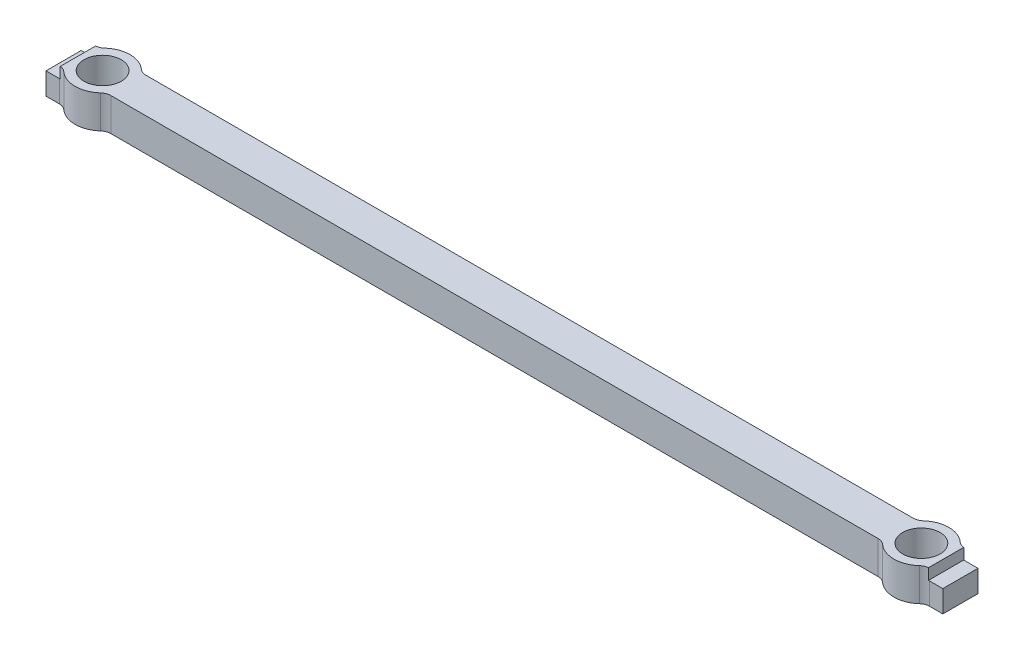
ISO-10303-21;
HEADER;
FILE_DESCRIPTION(('STEP AP214'),'2;1');
FILE_NAME('part.step','',(''),(''),'','','');
FILE_SCHEMA(('AUTOMOTIVE_DESIGN { 1 0 10303 214 1 1 1 1 }'));
ENDSEC;
DATA;
#1=APPLICATION_CONTEXT('core data for automotive mechanical design processes');
#2=APPLICATION_PROTOCOL_DEFINITION('international standard','automotive_design',2000,#1);
#3=PRODUCT_CONTEXT('',#1,'mechanical');
#4=PRODUCT('Part','Part','',(#3));
#5=PRODUCT_RELATED_PRODUCT_CATEGORY('part','',(#4));
#6=PRODUCT_DEFINITION_FORMATION('','',#4);
#7=PRODUCT_DEFINITION_CONTEXT('part definition',#1,'design');
#8=PRODUCT_DEFINITION('design','',#6,#7);
#9=PRODUCT_DEFINITION_SHAPE('','',#8);
#10=(LENGTH_UNIT() NAMED_UNIT(*) SI_UNIT(.MILLI.,.METRE.));
#11=(NAMED_UNIT(*) PLANE_ANGLE_UNIT() SI_UNIT($,.RADIAN.));
#12=(NAMED_UNIT(*) SI_UNIT($,.STERADIAN.) SOLID_ANGLE_UNIT());
#13=UNCERTAINTY_MEASURE_WITH_UNIT(LENGTH_MEASURE(1.E-05),#10,'distance_accuracy_value','');
#14=(GEOMETRIC_REPRESENTATION_CONTEXT(3) GLOBAL_UNCERTAINTY_ASSIGNED_CONTEXT((#13)) GLOBAL_UNIT_ASSIGNED_CONTEXT((#10,
#11,#12)) REPRESENTATION_CONTEXT('',''));
#15=CARTESIAN_POINT('',(0.,0.,0.));
#16=DIRECTION('',(0.,0.,1.));
#17=DIRECTION('',(1.,0.,0.));
#18=AXIS2_PLACEMENT_3D('',#15,#16,#17);
#19=CARTESIAN_POINT('',(0.,3.,-1.6));
#20=DIRECTION('',(0.,0.,1.));
#21=DIRECTION('',(1.,0.,0.));
#22=AXIS2_PLACEMENT_3D('',#19,#20,#21);
#23=PLANE('',#22);
#24=DIRECTION('',(1.,0.,0.));
#25=VECTOR('',#24,1.);
#26=CARTESIAN_POINT('',(0.,2.,-1.6));
#27=LINE('',#26,#25);
#28=CARTESIAN_POINT('',(-40.8,2.,-1.6));
#29=VERTEX_POINT('',#28);
#30=CARTESIAN_POINT('',(-39.593074902772,2.,-1.6));
#31=VERTEX_POINT('',#30);
#32=EDGE_CURVE('E473',#29,#31,#27,.T.);
#33=ORIENTED_EDGE('',*,*,#32,.T.);
#34=DIRECTION('',(0.,1.,0.));
#35=VECTOR('',#34,1.);
#36=CARTESIAN_POINT('',(-39.593074902772,0.,-1.6));
#37=LINE('',#36,#35);
#38=CARTESIAN_POINT('',(-39.593074902772,0.,-1.6));
#39=VERTEX_POINT('',#38);
#40=EDGE_CURVE('E277',#31,#39,#37,.F.);
#41=ORIENTED_EDGE('',*,*,#40,.T.);
#42=DIRECTION('',(-1.,0.,0.));
#43=VECTOR('',#42,1.);
#44=CARTESIAN_POINT('',(0.,0.,-1.6));
#45=LINE('',#44,#43);
#46=CARTESIAN_POINT('',(-40.8,0.,-1.6));
#47=VERTEX_POINT('',#46);
#48=EDGE_CURVE('E409',#39,#47,#45,.T.);
#49=ORIENTED_EDGE('',*,*,#48,.T.);
#50=DIRECTION('',(0.,-1.,0.));
#51=VECTOR('',#50,1.);
#52=CARTESIAN_POINT('',(-40.8,3.,-1.6));
#53=LINE('',#52,#51);
#54=EDGE_CURVE('E355',#29,#47,#53,.T.);
#55=ORIENTED_EDGE('',*,*,#54,.F.);
#56=EDGE_LOOP('',(#33,#41,#49,#55));
#57=FACE_BOUND('',#56,.T.);
#58=ADVANCED_FACE('F45',(#57),#23,.F.);
#59=CARTESIAN_POINT('',(-40.8,3.,0.));
#60=DIRECTION('',(1.,0.,0.));
#61=DIRECTION('',(0.,0.,-1.));
#62=AXIS2_PLACEMENT_3D('',#59,#60,#61);
#63=PLANE('',#62);
#64=DIRECTION('',(0.,0.,-1.));
#65=VECTOR('',#64,1.);
#66=CARTESIAN_POINT('',(-40.8,2.,0.));
#67=LINE('',#66,#65);
#68=CARTESIAN_POINT('',(-40.8,2.,1.6));
#69=VERTEX_POINT('',#68);
#70=EDGE_CURVE('E467',#69,#29,#67,.T.);
#71=ORIENTED_EDGE('',*,*,#70,.T.);
#72=ORIENTED_EDGE('',*,*,#54,.T.);
#73=DIRECTION('',(0.,0.,1.));
#74=VECTOR('',#73,1.);
#75=CARTESIAN_POINT('',(-40.8,0.,0.));
#76=LINE('',#75,#74);
#77=CARTESIAN_POINT('',(-40.8,0.,1.6));
#78=VERTEX_POINT('',#77);
#79=EDGE_CURVE('E412',#47,#78,#76,.T.);
#80=ORIENTED_EDGE('',*,*,#79,.T.);
#81=DIRECTION('',(0.,-1.,0.));
#82=VECTOR('',#81,1.);
#83=CARTESIAN_POINT('',(-40.8,3.,1.6));
#84=LINE('',#83,#82);
#85=EDGE_CURVE('E353',#69,#78,#84,.T.);
#86=ORIENTED_EDGE('',*,*,#85,.F.);
#87=EDGE_LOOP('',(#71,#72,#80,#86));
#88=FACE_BOUND('',#87,.T.);
#89=ADVANCED_FACE('F466',(#88),#63,.F.);
#90=CARTESIAN_POINT('',(0.,3.,1.6));
#91=DIRECTION('',(0.,0.,1.));
#92=DIRECTION('',(1.,0.,0.));
#93=AXIS2_PLACEMENT_3D('',#90,#91,#92);
#94=PLANE('',#93);
#95=DIRECTION('',(0.,-1.,0.));
#96=VECTOR('',#95,1.);
#97=CARTESIAN_POINT('',(-39.593074902772,3.,1.6));
#98=LINE('',#97,#96);
#99=CARTESIAN_POINT('',(-39.593074902772,0.,1.6));
#100=VERTEX_POINT('',#99);
#101=CARTESIAN_POINT('',(-39.593074902772,2.,1.6));
#102=VERTEX_POINT('',#101);
#103=EDGE_CURVE('E279',#100,#102,#98,.F.);
#104=ORIENTED_EDGE('',*,*,#103,.T.);
#105=DIRECTION('',(-1.,0.,0.));
#106=VECTOR('',#105,1.);
#107=CARTESIAN_POINT('',(0.,2.,1.6));
#108=LINE('',#107,#106);
#109=EDGE_CURVE('E60',#102,#69,#108,.T.);
#110=ORIENTED_EDGE('',*,*,#109,.T.);
#111=ORIENTED_EDGE('',*,*,#85,.T.);
#112=DIRECTION('',(-1.,0.,0.));
#113=VECTOR('',#112,1.);
#114=CARTESIAN_POINT('',(0.,0.,1.6));
#115=LINE('',#114,#113);
#116=EDGE_CURVE('E274',#100,#78,#115,.T.);
#117=ORIENTED_EDGE('',*,*,#116,.F.);
#118=EDGE_LOOP('',(#104,#110,#111,#117));
#119=FACE_BOUND('',#118,.T.);
#120=ADVANCED_FACE('F462',(#119),#94,.T.);
#121=CARTESIAN_POINT('',(0.,3.,1.6));
#122=DIRECTION('',(0.,0.,1.));
#123=DIRECTION('',(1.,0.,0.));
#124=AXIS2_PLACEMENT_3D('',#121,#122,#123);
#125=PLANE('',#124);
#126=DIRECTION('',(0.,-1.,0.));
#127=VECTOR('',#126,1.);
#128=CARTESIAN_POINT('',(40.8,3.,1.6));
#129=LINE('',#128,#127);
#130=CARTESIAN_POINT('',(40.8,2.,1.6));
#131=VERTEX_POINT('',#130);
#132=CARTESIAN_POINT('',(40.8,0.,1.6));
#133=VERTEX_POINT('',#132);
#134=EDGE_CURVE('E350',#131,#133,#129,.T.);
#135=ORIENTED_EDGE('',*,*,#134,.F.);
#136=DIRECTION('',(-1.,0.,0.));
#137=VECTOR('',#136,1.);
#138=CARTESIAN_POINT('',(0.,2.,1.6));
#139=LINE('',#138,#137);
#140=CARTESIAN_POINT('',(39.593074902772,2.,1.6));
#141=VERTEX_POINT('',#140);
#142=EDGE_CURVE('E438',#131,#141,#139,.T.);
#143=ORIENTED_EDGE('',*,*,#142,.T.);
#144=DIRECTION('',(0.,1.,0.));
#145=VECTOR('',#144,1.);
#146=CARTESIAN_POINT('',(39.593074902772,0.,1.6));
#147=LINE('',#146,#145);
#148=CARTESIAN_POINT('',(39.593074902772,0.,1.6));
#149=VERTEX_POINT('',#148);
#150=EDGE_CURVE('E296',#141,#149,#147,.F.);
#151=ORIENTED_EDGE('',*,*,#150,.T.);
#152=DIRECTION('',(-1.,0.,0.));
#153=VECTOR('',#152,1.);
#154=CARTESIAN_POINT('',(0.,0.,1.6));
#155=LINE('',#154,#153);
#156=EDGE_CURVE('E422',#133,#149,#155,.T.);
#157=ORIENTED_EDGE('',*,*,#156,.F.);
#158=EDGE_LOOP('',(#135,#143,#151,#157));
#159=FACE_BOUND('',#158,.T.);
#160=ADVANCED_FACE('F435',(#159),#125,.T.);
#161=CARTESIAN_POINT('',(40.8,3.,0.));
#162=DIRECTION('',(1.,0.,0.));
#163=DIRECTION('',(0.,0.,-1.));
#164=AXIS2_PLACEMENT_3D('',#161,#162,#163);
#165=PLANE('',#164);
#166=DIRECTION('',(0.,-1.,0.));
#167=VECTOR('',#166,1.);
#168=CARTESIAN_POINT('',(40.8,3.,-1.6));
#169=LINE('',#168,#167);
#170=CARTESIAN_POINT('',(40.8,2.,-1.6));
#171=VERTEX_POINT('',#170);
#172=CARTESIAN_POINT('',(40.8,0.,-1.6));
#173=VERTEX_POINT('',#172);
#174=EDGE_CURVE('E348',#171,#173,#169,.T.);
#175=ORIENTED_EDGE('',*,*,#174,.F.);
#176=DIRECTION('',(0.,0.,1.));
#177=VECTOR('',#176,1.);
#178=CARTESIAN_POINT('',(40.8,2.,0.));
#179=LINE('',#178,#177);
#180=EDGE_CURVE('E380',#171,#131,#179,.T.);
#181=ORIENTED_EDGE('',*,*,#180,.T.);
#182=ORIENTED_EDGE('',*,*,#134,.T.);
#183=DIRECTION('',(0.,0.,1.));
#184=VECTOR('',#183,1.);
#185=CARTESIAN_POINT('',(40.8,0.,0.));
#186=LINE('',#185,#184);
#187=EDGE_CURVE('E425',#173,#133,#186,.T.);
#188=ORIENTED_EDGE('',*,*,#187,.F.);
#189=EDGE_LOOP('',(#175,#181,#182,#188));
#190=FACE_BOUND('',#189,.T.);
#191=ADVANCED_FACE('F430',(#190),#165,.T.);
#192=CARTESIAN_POINT('',(0.,3.,-1.6));
#193=DIRECTION('',(0.,0.,1.));
#194=DIRECTION('',(1.,0.,0.));
#195=AXIS2_PLACEMENT_3D('',#192,#193,#194);
#196=PLANE('',#195);
#197=DIRECTION('',(1.,0.,0.));
#198=VECTOR('',#197,1.);
#199=CARTESIAN_POINT('',(0.,2.,-1.6));
#200=LINE('',#199,#198);
#201=CARTESIAN_POINT('',(39.593074902772,2.,-1.6));
#202=VERTEX_POINT('',#201);
#203=EDGE_CURVE('E367',#202,#171,#200,.T.);
#204=ORIENTED_EDGE('',*,*,#203,.T.);
#205=ORIENTED_EDGE('',*,*,#174,.T.);
#206=DIRECTION('',(-1.,0.,0.));
#207=VECTOR('',#206,1.);
#208=CARTESIAN_POINT('',(0.,0.,-1.6));
#209=LINE('',#208,#207);
#210=CARTESIAN_POINT('',(39.593074902772,0.,-1.6));
#211=VERTEX_POINT('',#210);
#212=EDGE_CURVE('E340',#173,#211,#209,.T.);
#213=ORIENTED_EDGE('',*,*,#212,.T.);
#214=DIRECTION('',(0.,-1.,0.));
#215=VECTOR('',#214,1.);
#216=CARTESIAN_POINT('',(39.593074902772,3.,-1.6));
#217=LINE('',#216,#215);
#218=EDGE_CURVE('E324',#211,#202,#217,.F.);
#219=ORIENTED_EDGE('',*,*,#218,.T.);
#220=EDGE_LOOP('',(#204,#205,#213,#219));
#221=FACE_BOUND('',#220,.T.);
#222=ADVANCED_FACE('F366',(#221),#196,.F.);
#223=CARTESIAN_POINT('',(0.,3.,0.));
#224=DIRECTION('',(0.,1.,0.));
#225=DIRECTION('',(0.,0.,1.));
#226=AXIS2_PLACEMENT_3D('',#223,#224,#225);
#227=PLANE('',#226);
#228=CARTESIAN_POINT('',(-37.25,3.,0.));
#229=DIRECTION('',(0.,1.,0.));
#230=DIRECTION('',(0.,0.,1.));
#231=AXIS2_PLACEMENT_3D('',#228,#229,#230);
#232=CIRCLE('',#231,1.7);
#233=CARTESIAN_POINT('',(-37.25,3.,1.7));
#234=VERTEX_POINT('',#233);
#235=EDGE_CURVE('E402',#234,#234,#232,.T.);
#236=ORIENTED_EDGE('',*,*,#235,.F.);
#237=EDGE_LOOP('',(#236));
#238=FACE_BOUND('',#237,.T.);
#239=CARTESIAN_POINT('',(37.25,3.,0.));
#240=DIRECTION('',(0.,1.,0.));
#241=DIRECTION('',(0.,0.,1.));
#242=AXIS2_PLACEMENT_3D('',#239,#240,#241);
#243=CIRCLE('',#242,1.7);
#244=CARTESIAN_POINT('',(37.25,3.,1.7));
#245=VERTEX_POINT('',#244);
#246=EDGE_CURVE('E351',#245,#245,#243,.F.);
#247=ORIENTED_EDGE('',*,*,#246,.T.);
#248=EDGE_LOOP('',(#247));
#249=FACE_BOUND('',#248,.T.);
#250=CARTESIAN_POINT('',(-39.593074902772,3.,-2.6));
#251=DIRECTION('',(0.,1.,0.));
#252=DIRECTION('',(0.,0.,1.));
#253=AXIS2_PLACEMENT_3D('',#250,#251,#252);
#254=CIRCLE('',#253,1.);
#255=CARTESIAN_POINT('',(-38.9236249305514,3.,-1.85714285714286));
#256=VERTEX_POINT('',#255);
#257=CARTESIAN_POINT('',(-39.5,3.,-1.60434089042786));
#258=VERTEX_POINT('',#257);
#259=EDGE_CURVE('E222',#256,#258,#254,.F.);
#260=ORIENTED_EDGE('',*,*,#259,.T.);
#261=DIRECTION('',(0.,0.,1.));
#262=VECTOR('',#261,1.);
#263=CARTESIAN_POINT('',(-39.5,3.,0.));
#264=LINE('',#263,#262);
#265=CARTESIAN_POINT('',(-39.5,3.,1.60434089042786));
#266=VERTEX_POINT('',#265);
#267=EDGE_CURVE('E207',#258,#266,#264,.T.);
#268=ORIENTED_EDGE('',*,*,#267,.T.);
#269=CARTESIAN_POINT('',(-39.593074902772,3.,2.6));
#270=DIRECTION('',(0.,1.,0.));
#271=DIRECTION('',(0.,0.,1.));
#272=AXIS2_PLACEMENT_3D('',#269,#270,#271);
#273=CIRCLE('',#272,1.);
#274=CARTESIAN_POINT('',(-38.9236249305514,3.,1.85714285714286));
#275=VERTEX_POINT('',#274);
#276=EDGE_CURVE('E242',#266,#275,#273,.F.);
#277=ORIENTED_EDGE('',*,*,#276,.T.);
#278=CARTESIAN_POINT('',(-37.25,3.,0.));
#279=DIRECTION('',(0.,1.,0.));
#280=DIRECTION('',(0.,0.,1.));
#281=AXIS2_PLACEMENT_3D('',#278,#279,#280);
#282=CIRCLE('',#281,2.5);
#283=CARTESIAN_POINT('',(-35.5763750694486,3.,1.85714285714286));
#284=VERTEX_POINT('',#283);
#285=EDGE_CURVE('E316',#275,#284,#282,.T.);
#286=ORIENTED_EDGE('',*,*,#285,.T.);
#287=CARTESIAN_POINT('',(-34.906925097228,3.,2.6));
#288=DIRECTION('',(0.,1.,0.));
#289=DIRECTION('',(0.,0.,1.));
#290=AXIS2_PLACEMENT_3D('',#287,#288,#289);
#291=CIRCLE('',#290,1.);
#292=CARTESIAN_POINT('',(-34.906925097228,3.,1.6));
#293=VERTEX_POINT('',#292);
#294=EDGE_CURVE('E13',#284,#293,#291,.F.);
#295=ORIENTED_EDGE('',*,*,#294,.T.);
#296=DIRECTION('',(-1.,0.,0.));
#297=VECTOR('',#296,1.);
#298=CARTESIAN_POINT('',(0.,3.,1.6));
#299=LINE('',#298,#297);
#300=CARTESIAN_POINT('',(34.906925097228,3.,1.6));
#301=VERTEX_POINT('',#300);
#302=EDGE_CURVE('E392',#301,#293,#299,.T.);
#303=ORIENTED_EDGE('',*,*,#302,.F.);
#304=CARTESIAN_POINT('',(34.906925097228,3.,2.6));
#305=DIRECTION('',(0.,1.,0.));
#306=DIRECTION('',(0.,0.,1.));
#307=AXIS2_PLACEMENT_3D('',#304,#305,#306);
#308=CIRCLE('',#307,1.);
#309=CARTESIAN_POINT('',(35.5763750694486,3.,1.85714285714286));
#310=VERTEX_POINT('',#309);
#311=EDGE_CURVE('E246',#301,#310,#308,.F.);
#312=ORIENTED_EDGE('',*,*,#311,.T.);
#313=CARTESIAN_POINT('',(37.25,3.,0.));
#314=DIRECTION('',(0.,1.,0.));
#315=DIRECTION('',(0.,0.,1.));
#316=AXIS2_PLACEMENT_3D('',#313,#314,#315);
#317=CIRCLE('',#316,2.5);
#318=CARTESIAN_POINT('',(38.9236249305514,3.,1.85714285714286));
#319=VERTEX_POINT('',#318);
#320=EDGE_CURVE('E395',#319,#310,#317,.F.);
#321=ORIENTED_EDGE('',*,*,#320,.F.);
#322=CARTESIAN_POINT('',(39.593074902772,3.,2.6));
#323=DIRECTION('',(0.,1.,0.));
#324=DIRECTION('',(0.,0.,1.));
#325=AXIS2_PLACEMENT_3D('',#322,#323,#324);
#326=CIRCLE('',#325,1.);
#327=CARTESIAN_POINT('',(39.5,3.,1.60434089042786));
#328=VERTEX_POINT('',#327);
#329=EDGE_CURVE('E250',#319,#328,#326,.F.);
#330=ORIENTED_EDGE('',*,*,#329,.T.);
#331=DIRECTION('',(0.,0.,1.));
#332=VECTOR('',#331,1.);
#333=CARTESIAN_POINT('',(39.5,3.,0.));
#334=LINE('',#333,#332);
#335=CARTESIAN_POINT('',(39.5,3.,-1.60434089042786));
#336=VERTEX_POINT('',#335);
#337=EDGE_CURVE('E384',#336,#328,#334,.T.);
#338=ORIENTED_EDGE('',*,*,#337,.F.);
#339=CARTESIAN_POINT('',(39.593074902772,3.,-2.6));
#340=DIRECTION('',(0.,1.,0.));
#341=DIRECTION('',(0.,0.,1.));
#342=AXIS2_PLACEMENT_3D('',#339,#340,#341);
#343=CIRCLE('',#342,1.);
#344=CARTESIAN_POINT('',(38.9236249305514,3.,-1.85714285714286));
#345=VERTEX_POINT('',#344);
#346=EDGE_CURVE('E300',#336,#345,#343,.F.);
#347=ORIENTED_EDGE('',*,*,#346,.T.);
#348=CARTESIAN_POINT('',(37.25,3.,0.));
#349=DIRECTION('',(0.,1.,0.));
#350=DIRECTION('',(0.,0.,1.));
#351=AXIS2_PLACEMENT_3D('',#348,#349,#350);
#352=CIRCLE('',#351,2.5);
#353=CARTESIAN_POINT('',(35.5763750694486,3.,-1.85714285714286));
#354=VERTEX_POINT('',#353);
#355=EDGE_CURVE('E398',#354,#345,#352,.F.);
#356=ORIENTED_EDGE('',*,*,#355,.F.);
#357=CARTESIAN_POINT('',(34.906925097228,3.,-2.6));
#358=DIRECTION('',(0.,1.,0.));
#359=DIRECTION('',(0.,0.,1.));
#360=AXIS2_PLACEMENT_3D('',#357,#358,#359);
#361=CIRCLE('',#360,1.);
#362=CARTESIAN_POINT('',(34.906925097228,3.,-1.6));
#363=VERTEX_POINT('',#362);
#364=EDGE_CURVE('E233',#354,#363,#361,.F.);
#365=ORIENTED_EDGE('',*,*,#364,.T.);
#366=DIRECTION('',(-1.,0.,0.));
#367=VECTOR('',#366,1.);
#368=CARTESIAN_POINT('',(0.,3.,-1.6));
#369=LINE('',#368,#367);
#370=CARTESIAN_POINT('',(-34.906925097228,3.,-1.6));
#371=VERTEX_POINT('',#370);
#372=EDGE_CURVE('E306',#363,#371,#369,.T.);
#373=ORIENTED_EDGE('',*,*,#372,.T.);
#374=CARTESIAN_POINT('',(-34.906925097228,3.,-2.6));
#375=DIRECTION('',(0.,1.,0.));
#376=DIRECTION('',(0.,0.,1.));
#377=AXIS2_PLACEMENT_3D('',#374,#375,#376);
#378=CIRCLE('',#377,1.);
#379=CARTESIAN_POINT('',(-35.5763750694486,3.,-1.85714285714286));
#380=VERTEX_POINT('',#379);
#381=EDGE_CURVE('E235',#371,#380,#378,.F.);
#382=ORIENTED_EDGE('',*,*,#381,.T.);
#383=CARTESIAN_POINT('',(-37.25,3.,0.));
#384=DIRECTION('',(0.,1.,0.));
#385=DIRECTION('',(0.,0.,1.));
#386=AXIS2_PLACEMENT_3D('',#383,#384,#385);
#387=CIRCLE('',#386,2.5);
#388=EDGE_CURVE('E229',#380,#256,#387,.T.);
#389=ORIENTED_EDGE('',*,*,#388,.T.);
#390=EDGE_LOOP('',(#260,#268,#277,#286,#295,#303,#312,#321,#330,#338,#347,#356,#365,#373,#382,#389));
#391=FACE_BOUND('',#390,.T.);
#392=ADVANCED_FACE('F227',(#238,#249,#391),#227,.T.);
#393=CARTESIAN_POINT('',(-39.593074902772,3.,-2.6));
#394=DIRECTION('',(0.,-1.,0.));
#395=DIRECTION('',(0.,0.,-1.));
#396=AXIS2_PLACEMENT_3D('',#393,#394,#395);
#397=CYLINDRICAL_SURFACE('',#396,1.);
#398=DIRECTION('',(0.,1.,0.));
#399=VECTOR('',#398,1.);
#400=CARTESIAN_POINT('',(-39.5,-3.46202812969442,-1.60434089042786));
#401=LINE('',#400,#399);
#402=CARTESIAN_POINT('',(-39.5,2.,-1.60434089042786));
#403=VERTEX_POINT('',#402);
#404=EDGE_CURVE('E210',#403,#258,#401,.T.);
#405=ORIENTED_EDGE('',*,*,#404,.T.);
#406=ORIENTED_EDGE('',*,*,#259,.F.);
#407=DIRECTION('',(0.,-1.,0.));
#408=VECTOR('',#407,1.);
#409=CARTESIAN_POINT('',(-38.9236249305514,3.,-1.85714285714286));
#410=LINE('',#409,#408);
#411=CARTESIAN_POINT('',(-38.9236249305514,0.,-1.85714285714286));
#412=VERTEX_POINT('',#411);
#413=EDGE_CURVE('E315',#412,#256,#410,.F.);
#414=ORIENTED_EDGE('',*,*,#413,.F.);
#415=CARTESIAN_POINT('',(-39.593074902772,0.,-2.6));
#416=DIRECTION('',(0.,1.,0.));
#417=DIRECTION('',(0.,0.,1.));
#418=AXIS2_PLACEMENT_3D('',#415,#416,#417);
#419=CIRCLE('',#418,1.);
#420=EDGE_CURVE('E231',#39,#412,#419,.T.);
#421=ORIENTED_EDGE('',*,*,#420,.F.);
#422=ORIENTED_EDGE('',*,*,#40,.F.);
#423=CARTESIAN_POINT('',(-39.593074902772,2.,-2.6));
#424=DIRECTION('',(0.,1.,0.));
#425=DIRECTION('',(0.,0.,1.));
#426=AXIS2_PLACEMENT_3D('',#423,#424,#425);
#427=CIRCLE('',#426,1.);
#428=EDGE_CURVE('E224',#31,#403,#427,.T.);
#429=ORIENTED_EDGE('',*,*,#428,.T.);
#430=EDGE_LOOP('',(#405,#406,#414,#421,#422,#429));
#431=FACE_BOUND('',#430,.T.);
#432=ADVANCED_FACE('F220',(#431),#397,.F.);
#433=CARTESIAN_POINT('',(-39.593074902772,3.,2.6));
#434=DIRECTION('',(0.,-1.,0.));
#435=DIRECTION('',(0.,0.,-1.));
#436=AXIS2_PLACEMENT_3D('',#433,#434,#435);
#437=CYLINDRICAL_SURFACE('',#436,1.);
#438=DIRECTION('',(0.,1.,0.));
#439=VECTOR('',#438,1.);
#440=CARTESIAN_POINT('',(-39.5,-3.46202812969442,1.60434089042786));
#441=LINE('',#440,#439);
#442=CARTESIAN_POINT('',(-39.5,2.,1.60434089042786));
#443=VERTEX_POINT('',#442);
#444=EDGE_CURVE('E213',#443,#266,#441,.T.);
#445=ORIENTED_EDGE('',*,*,#444,.F.);
#446=CARTESIAN_POINT('',(-39.593074902772,2.,2.6));
#447=DIRECTION('',(0.,1.,0.));
#448=DIRECTION('',(0.,0.,1.));
#449=AXIS2_PLACEMENT_3D('',#446,#447,#448);
#450=CIRCLE('',#449,1.);
#451=EDGE_CURVE('E479',#443,#102,#450,.T.);
#452=ORIENTED_EDGE('',*,*,#451,.T.);
#453=ORIENTED_EDGE('',*,*,#103,.F.);
#454=CARTESIAN_POINT('',(-39.593074902772,0.,2.6));
#455=DIRECTION('',(0.,1.,0.));
#456=DIRECTION('',(0.,0.,1.));
#457=AXIS2_PLACEMENT_3D('',#454,#455,#456);
#458=CIRCLE('',#457,1.);
#459=CARTESIAN_POINT('',(-38.9236249305514,0.,1.85714285714286));
#460=VERTEX_POINT('',#459);
#461=EDGE_CURVE('E240',#460,#100,#458,.T.);
#462=ORIENTED_EDGE('',*,*,#461,.F.);
#463=DIRECTION('',(0.,-1.,0.));
#464=VECTOR('',#463,1.);
#465=CARTESIAN_POINT('',(-38.9236249305514,3.,1.85714285714286));
#466=LINE('',#465,#464);
#467=EDGE_CURVE('E273',#275,#460,#466,.T.);
#468=ORIENTED_EDGE('',*,*,#467,.F.);
#469=ORIENTED_EDGE('',*,*,#276,.F.);
#470=EDGE_LOOP('',(#445,#452,#453,#462,#468,#469));
#471=FACE_BOUND('',#470,.T.);
#472=ADVANCED_FACE('F457',(#471),#437,.F.);
#473=CARTESIAN_POINT('',(-37.25,3.,0.));
#474=DIRECTION('',(0.,-1.,0.));
#475=DIRECTION('',(0.,0.,-1.));
#476=AXIS2_PLACEMENT_3D('',#473,#474,#475);
#477=CYLINDRICAL_SURFACE('',#476,2.5);
#478=ORIENTED_EDGE('',*,*,#388,.F.);
#479=DIRECTION('',(0.,-1.,0.));
#480=VECTOR('',#479,1.);
#481=CARTESIAN_POINT('',(-35.5763750694486,3.,-1.85714285714286));
#482=LINE('',#481,#480);
#483=CARTESIAN_POINT('',(-35.5763750694486,0.,-1.85714285714286));
#484=VERTEX_POINT('',#483);
#485=EDGE_CURVE('E314',#380,#484,#482,.T.);
#486=ORIENTED_EDGE('',*,*,#485,.T.);
#487=CARTESIAN_POINT('',(-37.25,0.,0.));
#488=DIRECTION('',(0.,1.,0.));
#489=DIRECTION('',(0.,0.,1.));
#490=AXIS2_PLACEMENT_3D('',#487,#488,#489);
#491=CIRCLE('',#490,2.5);
#492=EDGE_CURVE('E407',#484,#412,#491,.T.);
#493=ORIENTED_EDGE('',*,*,#492,.T.);
#494=ORIENTED_EDGE('',*,*,#413,.T.);
#495=EDGE_LOOP('',(#478,#486,#493,#494));
#496=FACE_BOUND('',#495,.T.);
#497=ADVANCED_FACE('F312',(#496),#477,.T.);
#498=CARTESIAN_POINT('',(-37.25,3.,0.));
#499=DIRECTION('',(0.,-1.,0.));
#500=DIRECTION('',(0.,0.,-1.));
#501=AXIS2_PLACEMENT_3D('',#498,#499,#500);
#502=CYLINDRICAL_SURFACE('',#501,2.5);
#503=ORIENTED_EDGE('',*,*,#285,.F.);
#504=ORIENTED_EDGE('',*,*,#467,.T.);
#505=CARTESIAN_POINT('',(-37.25,0.,0.));
#506=DIRECTION('',(0.,1.,0.));
#507=DIRECTION('',(0.,0.,1.));
#508=AXIS2_PLACEMENT_3D('',#505,#506,#507);
#509=CIRCLE('',#508,2.5);
#510=CARTESIAN_POINT('',(-35.5763750694486,0.,1.85714285714286));
#511=VERTEX_POINT('',#510);
#512=EDGE_CURVE('E259',#460,#511,#509,.T.);
#513=ORIENTED_EDGE('',*,*,#512,.T.);
#514=DIRECTION('',(0.,-1.,0.));
#515=VECTOR('',#514,1.);
#516=CARTESIAN_POINT('',(-35.5763750694486,3.,1.85714285714286));
#517=LINE('',#516,#515);
#518=EDGE_CURVE('E270',#511,#284,#517,.F.);
#519=ORIENTED_EDGE('',*,*,#518,.T.);
#520=EDGE_LOOP('',(#503,#504,#513,#519));
#521=FACE_BOUND('',#520,.T.);
#522=ADVANCED_FACE('F269',(#521),#502,.T.);
#523=CARTESIAN_POINT('',(0.,3.,1.6));
#524=DIRECTION('',(0.,0.,1.));
#525=DIRECTION('',(1.,0.,0.));
#526=AXIS2_PLACEMENT_3D('',#523,#524,#525);
#527=PLANE('',#526);
#528=DIRECTION('',(-1.,0.,0.));
#529=VECTOR('',#528,1.);
#530=CARTESIAN_POINT('',(0.,0.,1.6));
#531=LINE('',#530,#529);
#532=CARTESIAN_POINT('',(34.906925097228,0.,1.6));
#533=VERTEX_POINT('',#532);
#534=CARTESIAN_POINT('',(-34.906925097228,0.,1.6));
#535=VERTEX_POINT('',#534);
#536=EDGE_CURVE('E261',#533,#535,#531,.T.);
#537=ORIENTED_EDGE('',*,*,#536,.F.);
#538=DIRECTION('',(0.,1.,0.));
#539=VECTOR('',#538,1.);
#540=CARTESIAN_POINT('',(34.906925097228,3.,1.6));
#541=LINE('',#540,#539);
#542=EDGE_CURVE('E294',#533,#301,#541,.T.);
#543=ORIENTED_EDGE('',*,*,#542,.T.);
#544=ORIENTED_EDGE('',*,*,#302,.T.);
#545=DIRECTION('',(0.,-1.,0.));
#546=VECTOR('',#545,1.);
#547=CARTESIAN_POINT('',(-34.906925097228,3.,1.6));
#548=LINE('',#547,#546);
#549=EDGE_CURVE('E292',#293,#535,#548,.T.);
#550=ORIENTED_EDGE('',*,*,#549,.T.);
#551=EDGE_LOOP('',(#537,#543,#544,#550));
#552=FACE_BOUND('',#551,.T.);
#553=ADVANCED_FACE('F454',(#552),#527,.T.);
#554=CARTESIAN_POINT('',(37.25,3.,0.));
#555=DIRECTION('',(0.,-1.,0.));
#556=DIRECTION('',(0.,0.,-1.));
#557=AXIS2_PLACEMENT_3D('',#554,#555,#556);
#558=CYLINDRICAL_SURFACE('',#557,2.5);
#559=ORIENTED_EDGE('',*,*,#320,.T.);
#560=DIRECTION('',(0.,-1.,0.));
#561=VECTOR('',#560,1.);
#562=CARTESIAN_POINT('',(35.5763750694486,3.,1.85714285714286));
#563=LINE('',#562,#561);
#564=CARTESIAN_POINT('',(35.5763750694486,0.,1.85714285714286));
#565=VERTEX_POINT('',#564);
#566=EDGE_CURVE('E289',#310,#565,#563,.T.);
#567=ORIENTED_EDGE('',*,*,#566,.T.);
#568=CARTESIAN_POINT('',(37.25,0.,0.));
#569=DIRECTION('',(0.,1.,0.));
#570=DIRECTION('',(0.,0.,1.));
#571=AXIS2_PLACEMENT_3D('',#568,#569,#570);
#572=CIRCLE('',#571,2.5);
#573=CARTESIAN_POINT('',(38.9236249305514,0.,1.85714285714286));
#574=VERTEX_POINT('',#573);
#575=EDGE_CURVE('E419',#574,#565,#572,.F.);
#576=ORIENTED_EDGE('',*,*,#575,.F.);
#577=DIRECTION('',(0.,-1.,0.));
#578=VECTOR('',#577,1.);
#579=CARTESIAN_POINT('',(38.9236249305514,3.,1.85714285714286));
#580=LINE('',#579,#578);
#581=EDGE_CURVE('E287',#574,#319,#580,.F.);
#582=ORIENTED_EDGE('',*,*,#581,.T.);
#583=EDGE_LOOP('',(#559,#567,#576,#582));
#584=FACE_BOUND('',#583,.T.);
#585=ADVANCED_FACE('F446',(#584),#558,.T.);
#586=CARTESIAN_POINT('',(37.25,3.,0.));
#587=DIRECTION('',(0.,-1.,0.));
#588=DIRECTION('',(0.,0.,-1.));
#589=AXIS2_PLACEMENT_3D('',#586,#587,#588);
#590=CYLINDRICAL_SURFACE('',#589,2.5);
#591=ORIENTED_EDGE('',*,*,#355,.T.);
#592=DIRECTION('',(0.,-1.,0.));
#593=VECTOR('',#592,1.);
#594=CARTESIAN_POINT('',(38.9236249305514,3.,-1.85714285714286));
#595=LINE('',#594,#593);
#596=CARTESIAN_POINT('',(38.9236249305514,0.,-1.85714285714286));
#597=VERTEX_POINT('',#596);
#598=EDGE_CURVE('E359',#345,#597,#595,.T.);
#599=ORIENTED_EDGE('',*,*,#598,.T.);
#600=CARTESIAN_POINT('',(37.25,0.,0.));
#601=DIRECTION('',(0.,1.,0.));
#602=DIRECTION('',(0.,0.,1.));
#603=AXIS2_PLACEMENT_3D('',#600,#601,#602);
#604=CIRCLE('',#603,2.5);
#605=CARTESIAN_POINT('',(35.5763750694486,0.,-1.85714285714286));
#606=VERTEX_POINT('',#605);
#607=EDGE_CURVE('E334',#606,#597,#604,.F.);
#608=ORIENTED_EDGE('',*,*,#607,.F.);
#609=DIRECTION('',(0.,-1.,0.));
#610=VECTOR('',#609,1.);
#611=CARTESIAN_POINT('',(35.5763750694486,3.,-1.85714285714286));
#612=LINE('',#611,#610);
#613=EDGE_CURVE('E357',#606,#354,#612,.F.);
#614=ORIENTED_EDGE('',*,*,#613,.T.);
#615=EDGE_LOOP('',(#591,#599,#608,#614));
#616=FACE_BOUND('',#615,.T.);
#617=ADVANCED_FACE('F641',(#616),#590,.T.);
#618=CARTESIAN_POINT('',(-37.25,3.,0.));
#619=DIRECTION('',(0.,-1.,0.));
#620=DIRECTION('',(0.,0.,-1.));
#621=AXIS2_PLACEMENT_3D('',#618,#619,#620);
#622=CYLINDRICAL_SURFACE('',#621,1.7);
#623=ORIENTED_EDGE('',*,*,#235,.T.);
#624=EDGE_LOOP('',(#623));
#625=FACE_BOUND('',#624,.T.);
#626=CARTESIAN_POINT('',(-37.25,0.,0.));
#627=DIRECTION('',(0.,1.,0.));
#628=DIRECTION('',(0.,0.,1.));
#629=AXIS2_PLACEMENT_3D('',#626,#627,#628);
#630=CIRCLE('',#629,1.7);
#631=CARTESIAN_POINT('',(-37.25,0.,1.7));
#632=VERTEX_POINT('',#631);
#633=EDGE_CURVE('E333',#632,#632,#630,.T.);
#634=ORIENTED_EDGE('',*,*,#633,.F.);
#635=EDGE_LOOP('',(#634));
#636=FACE_BOUND('',#635,.T.);
#637=ADVANCED_FACE('F645',(#625,#636),#622,.F.);
#638=CARTESIAN_POINT('',(0.,3.,-1.6));
#639=DIRECTION('',(0.,0.,1.));
#640=DIRECTION('',(1.,0.,0.));
#641=AXIS2_PLACEMENT_3D('',#638,#639,#640);
#642=PLANE('',#641);
#643=DIRECTION('',(-1.,0.,0.));
#644=VECTOR('',#643,1.);
#645=CARTESIAN_POINT('',(0.,0.,-1.6));
#646=LINE('',#645,#644);
#647=CARTESIAN_POINT('',(34.906925097228,0.,-1.6));
#648=VERTEX_POINT('',#647);
#649=CARTESIAN_POINT('',(-34.906925097228,0.,-1.6));
#650=VERTEX_POINT('',#649);
#651=EDGE_CURVE('E332',#648,#650,#646,.T.);
#652=ORIENTED_EDGE('',*,*,#651,.T.);
#653=DIRECTION('',(0.,1.,0.));
#654=VECTOR('',#653,1.);
#655=CARTESIAN_POINT('',(-34.906925097228,3.,-1.6));
#656=LINE('',#655,#654);
#657=EDGE_CURVE('E281',#650,#371,#656,.T.);
#658=ORIENTED_EDGE('',*,*,#657,.T.);
#659=ORIENTED_EDGE('',*,*,#372,.F.);
#660=DIRECTION('',(0.,-1.,0.));
#661=VECTOR('',#660,1.);
#662=CARTESIAN_POINT('',(34.906925097228,3.,-1.6));
#663=LINE('',#662,#661);
#664=EDGE_CURVE('E320',#363,#648,#663,.T.);
#665=ORIENTED_EDGE('',*,*,#664,.T.);
#666=EDGE_LOOP('',(#652,#658,#659,#665));
#667=FACE_BOUND('',#666,.T.);
#668=ADVANCED_FACE('F329',(#667),#642,.F.);
#669=CARTESIAN_POINT('',(37.25,3.,0.));
#670=DIRECTION('',(0.,-1.,0.));
#671=DIRECTION('',(0.,0.,-1.));
#672=AXIS2_PLACEMENT_3D('',#669,#670,#671);
#673=CYLINDRICAL_SURFACE('',#672,1.7);
#674=ORIENTED_EDGE('',*,*,#246,.F.);
#675=EDGE_LOOP('',(#674));
#676=FACE_BOUND('',#675,.T.);
#677=CARTESIAN_POINT('',(37.25,0.,0.));
#678=DIRECTION('',(0.,1.,0.));
#679=DIRECTION('',(0.,0.,1.));
#680=AXIS2_PLACEMENT_3D('',#677,#678,#679);
#681=CIRCLE('',#680,1.7);
#682=CARTESIAN_POINT('',(37.25,0.,1.7));
#683=VERTEX_POINT('',#682);
#684=EDGE_CURVE('E317',#683,#683,#681,.F.);
#685=ORIENTED_EDGE('',*,*,#684,.T.);
#686=EDGE_LOOP('',(#685));
#687=FACE_BOUND('',#686,.T.);
#688=ADVANCED_FACE('F649',(#676,#687),#673,.F.);
#689=CARTESIAN_POINT('',(0.,0.,0.));
#690=DIRECTION('',(0.,1.,0.));
#691=DIRECTION('',(0.,0.,1.));
#692=AXIS2_PLACEMENT_3D('',#689,#690,#691);
#693=PLANE('',#692);
#694=ORIENTED_EDGE('',*,*,#492,.F.);
#695=CARTESIAN_POINT('',(-34.906925097228,0.,-2.6));
#696=DIRECTION('',(0.,1.,0.));
#697=DIRECTION('',(0.,0.,1.));
#698=AXIS2_PLACEMENT_3D('',#695,#696,#697);
#699=CIRCLE('',#698,1.);
#700=EDGE_CURVE('E302',#484,#650,#699,.T.);
#701=ORIENTED_EDGE('',*,*,#700,.T.);
#702=ORIENTED_EDGE('',*,*,#651,.F.);
#703=CARTESIAN_POINT('',(34.906925097228,0.,-2.6));
#704=DIRECTION('',(0.,1.,0.));
#705=DIRECTION('',(0.,0.,1.));
#706=AXIS2_PLACEMENT_3D('',#703,#704,#705);
#707=CIRCLE('',#706,1.);
#708=EDGE_CURVE('E230',#648,#606,#707,.T.);
#709=ORIENTED_EDGE('',*,*,#708,.T.);
#710=ORIENTED_EDGE('',*,*,#607,.T.);
#711=CARTESIAN_POINT('',(39.593074902772,0.,-2.6));
#712=DIRECTION('',(0.,1.,0.));
#713=DIRECTION('',(0.,0.,1.));
#714=AXIS2_PLACEMENT_3D('',#711,#712,#713);
#715=CIRCLE('',#714,1.);
#716=EDGE_CURVE('E298',#597,#211,#715,.T.);
#717=ORIENTED_EDGE('',*,*,#716,.T.);
#718=ORIENTED_EDGE('',*,*,#212,.F.);
#719=ORIENTED_EDGE('',*,*,#187,.T.);
#720=ORIENTED_EDGE('',*,*,#156,.T.);
#721=CARTESIAN_POINT('',(39.593074902772,0.,2.6));
#722=DIRECTION('',(0.,1.,0.));
#723=DIRECTION('',(0.,0.,1.));
#724=AXIS2_PLACEMENT_3D('',#721,#722,#723);
#725=CIRCLE('',#724,1.);
#726=EDGE_CURVE('E248',#149,#574,#725,.T.);
#727=ORIENTED_EDGE('',*,*,#726,.T.);
#728=ORIENTED_EDGE('',*,*,#575,.T.);
#729=CARTESIAN_POINT('',(34.906925097228,0.,2.6));
#730=DIRECTION('',(0.,1.,0.));
#731=DIRECTION('',(0.,0.,1.));
#732=AXIS2_PLACEMENT_3D('',#729,#730,#731);
#733=CIRCLE('',#732,1.);
#734=EDGE_CURVE('E244',#565,#533,#733,.T.);
#735=ORIENTED_EDGE('',*,*,#734,.T.);
#736=ORIENTED_EDGE('',*,*,#536,.T.);
#737=CARTESIAN_POINT('',(-34.906925097228,0.,2.6));
#738=DIRECTION('',(0.,1.,0.));
#739=DIRECTION('',(0.,0.,1.));
#740=AXIS2_PLACEMENT_3D('',#737,#738,#739);
#741=CIRCLE('',#740,1.);
#742=EDGE_CURVE('E53',#535,#511,#741,.T.);
#743=ORIENTED_EDGE('',*,*,#742,.T.);
#744=ORIENTED_EDGE('',*,*,#512,.F.);
#745=ORIENTED_EDGE('',*,*,#461,.T.);
#746=ORIENTED_EDGE('',*,*,#116,.T.);
#747=ORIENTED_EDGE('',*,*,#79,.F.);
#748=ORIENTED_EDGE('',*,*,#48,.F.);
#749=ORIENTED_EDGE('',*,*,#420,.T.);
#750=EDGE_LOOP('',(#694,#701,#702,#709,#710,#717,#718,#719,#720,#727,#728,#735,#736,#743,#744,
#745,#746,#747,#748,#749));
#751=FACE_BOUND('',#750,.T.);
#752=ORIENTED_EDGE('',*,*,#633,.T.);
#753=EDGE_LOOP('',(#752));
#754=FACE_BOUND('',#753,.T.);
#755=ORIENTED_EDGE('',*,*,#684,.F.);
#756=EDGE_LOOP('',(#755));
#757=FACE_BOUND('',#756,.T.);
#758=ADVANCED_FACE('F257',(#751,#754,#757),#693,.F.);
#759=CARTESIAN_POINT('',(39.593074902772,3.,-2.6));
#760=DIRECTION('',(0.,-1.,0.));
#761=DIRECTION('',(0.,0.,-1.));
#762=AXIS2_PLACEMENT_3D('',#759,#760,#761);
#763=CYLINDRICAL_SURFACE('',#762,1.);
#764=ORIENTED_EDGE('',*,*,#346,.F.);
#765=DIRECTION('',(0.,1.,0.));
#766=VECTOR('',#765,1.);
#767=CARTESIAN_POINT('',(39.5,-3.46202812969442,-1.60434089042786));
#768=LINE('',#767,#766);
#769=CARTESIAN_POINT('',(39.5,2.,-1.60434089042786));
#770=VERTEX_POINT('',#769);
#771=EDGE_CURVE('E377',#770,#336,#768,.T.);
#772=ORIENTED_EDGE('',*,*,#771,.F.);
#773=CARTESIAN_POINT('',(39.593074902772,2.,-2.6));
#774=DIRECTION('',(0.,1.,0.));
#775=DIRECTION('',(0.,0.,1.));
#776=AXIS2_PLACEMENT_3D('',#773,#774,#775);
#777=CIRCLE('',#776,1.);
#778=EDGE_CURVE('E376',#770,#202,#777,.T.);
#779=ORIENTED_EDGE('',*,*,#778,.T.);
#780=ORIENTED_EDGE('',*,*,#218,.F.);
#781=ORIENTED_EDGE('',*,*,#716,.F.);
#782=ORIENTED_EDGE('',*,*,#598,.F.);
#783=EDGE_LOOP('',(#764,#772,#779,#780,#781,#782));
#784=FACE_BOUND('',#783,.T.);
#785=ADVANCED_FACE('F373',(#784),#763,.F.);
#786=CARTESIAN_POINT('',(-34.906925097228,3.,-2.6));
#787=DIRECTION('',(0.,-1.,0.));
#788=DIRECTION('',(0.,0.,-1.));
#789=AXIS2_PLACEMENT_3D('',#786,#787,#788);
#790=CYLINDRICAL_SURFACE('',#789,1.);
#791=ORIENTED_EDGE('',*,*,#381,.F.);
#792=ORIENTED_EDGE('',*,*,#657,.F.);
#793=ORIENTED_EDGE('',*,*,#700,.F.);
#794=ORIENTED_EDGE('',*,*,#485,.F.);
#795=EDGE_LOOP('',(#791,#792,#793,#794));
#796=FACE_BOUND('',#795,.T.);
#797=ADVANCED_FACE('F319',(#796),#790,.F.);
#798=CARTESIAN_POINT('',(34.906925097228,3.,-2.6));
#799=DIRECTION('',(0.,-1.,0.));
#800=DIRECTION('',(0.,0.,-1.));
#801=AXIS2_PLACEMENT_3D('',#798,#799,#800);
#802=CYLINDRICAL_SURFACE('',#801,1.);
#803=ORIENTED_EDGE('',*,*,#364,.F.);
#804=ORIENTED_EDGE('',*,*,#613,.F.);
#805=ORIENTED_EDGE('',*,*,#708,.F.);
#806=ORIENTED_EDGE('',*,*,#664,.F.);
#807=EDGE_LOOP('',(#803,#804,#805,#806));
#808=FACE_BOUND('',#807,.T.);
#809=ADVANCED_FACE('F511',(#808),#802,.F.);
#810=CARTESIAN_POINT('',(34.906925097228,3.,2.6));
#811=DIRECTION('',(0.,-1.,0.));
#812=DIRECTION('',(0.,0.,-1.));
#813=AXIS2_PLACEMENT_3D('',#810,#811,#812);
#814=CYLINDRICAL_SURFACE('',#813,1.);
#815=ORIENTED_EDGE('',*,*,#311,.F.);
#816=ORIENTED_EDGE('',*,*,#542,.F.);
#817=ORIENTED_EDGE('',*,*,#734,.F.);
#818=ORIENTED_EDGE('',*,*,#566,.F.);
#819=EDGE_LOOP('',(#815,#816,#817,#818));
#820=FACE_BOUND('',#819,.T.);
#821=ADVANCED_FACE('F451',(#820),#814,.F.);
#822=CARTESIAN_POINT('',(39.593074902772,3.,2.6));
#823=DIRECTION('',(0.,-1.,0.));
#824=DIRECTION('',(0.,0.,-1.));
#825=AXIS2_PLACEMENT_3D('',#822,#823,#824);
#826=CYLINDRICAL_SURFACE('',#825,1.);
#827=CARTESIAN_POINT('',(39.593074902772,2.,2.6));
#828=DIRECTION('',(0.,1.,0.));
#829=DIRECTION('',(0.,0.,1.));
#830=AXIS2_PLACEMENT_3D('',#827,#828,#829);
#831=CIRCLE('',#830,1.);
#832=CARTESIAN_POINT('',(39.5,2.,1.60434089042786));
#833=VERTEX_POINT('',#832);
#834=EDGE_CURVE('E389',#141,#833,#831,.T.);
#835=ORIENTED_EDGE('',*,*,#834,.T.);
#836=DIRECTION('',(0.,1.,0.));
#837=VECTOR('',#836,1.);
#838=CARTESIAN_POINT('',(39.5,-3.46202812969442,1.60434089042786));
#839=LINE('',#838,#837);
#840=EDGE_CURVE('E386',#833,#328,#839,.T.);
#841=ORIENTED_EDGE('',*,*,#840,.T.);
#842=ORIENTED_EDGE('',*,*,#329,.F.);
#843=ORIENTED_EDGE('',*,*,#581,.F.);
#844=ORIENTED_EDGE('',*,*,#726,.F.);
#845=ORIENTED_EDGE('',*,*,#150,.F.);
#846=EDGE_LOOP('',(#835,#841,#842,#843,#844,#845));
#847=FACE_BOUND('',#846,.T.);
#848=ADVANCED_FACE('F442',(#847),#826,.F.);
#849=CARTESIAN_POINT('',(-34.906925097228,3.,2.6));
#850=DIRECTION('',(0.,-1.,0.));
#851=DIRECTION('',(0.,0.,-1.));
#852=AXIS2_PLACEMENT_3D('',#849,#850,#851);
#853=CYLINDRICAL_SURFACE('',#852,1.);
#854=ORIENTED_EDGE('',*,*,#294,.F.);
#855=ORIENTED_EDGE('',*,*,#518,.F.);
#856=ORIENTED_EDGE('',*,*,#742,.F.);
#857=ORIENTED_EDGE('',*,*,#549,.F.);
#858=EDGE_LOOP('',(#854,#855,#856,#857));
#859=FACE_BOUND('',#858,.T.);
#860=ADVANCED_FACE('F47',(#859),#853,.F.);
#861=CARTESIAN_POINT('',(39.5,-3.46202812969442,0.));
#862=DIRECTION('',(-1.,0.,0.));
#863=DIRECTION('',(0.,0.,1.));
#864=AXIS2_PLACEMENT_3D('',#861,#862,#863);
#865=PLANE('',#864);
#866=DIRECTION('',(0.,0.,-1.));
#867=VECTOR('',#866,1.);
#868=CARTESIAN_POINT('',(39.5,2.,0.));
#869=LINE('',#868,#867);
#870=EDGE_CURVE('E68',#833,#770,#869,.T.);
#871=ORIENTED_EDGE('',*,*,#870,.T.);
#872=ORIENTED_EDGE('',*,*,#771,.T.);
#873=ORIENTED_EDGE('',*,*,#337,.T.);
#874=ORIENTED_EDGE('',*,*,#840,.F.);
#875=EDGE_LOOP('',(#871,#872,#873,#874));
#876=FACE_BOUND('',#875,.T.);
#877=ADVANCED_FACE('F487',(#876),#865,.F.);
#878=CARTESIAN_POINT('',(0.,2.,0.));
#879=DIRECTION('',(0.,1.,0.));
#880=DIRECTION('',(0.,0.,1.));
#881=AXIS2_PLACEMENT_3D('',#878,#879,#880);
#882=PLANE('',#881);
#883=ORIENTED_EDGE('',*,*,#778,.F.);
#884=ORIENTED_EDGE('',*,*,#870,.F.);
#885=ORIENTED_EDGE('',*,*,#834,.F.);
#886=ORIENTED_EDGE('',*,*,#142,.F.);
#887=ORIENTED_EDGE('',*,*,#180,.F.);
#888=ORIENTED_EDGE('',*,*,#203,.F.);
#889=EDGE_LOOP('',(#883,#884,#885,#886,#887,#888));
#890=FACE_BOUND('',#889,.T.);
#891=ADVANCED_FACE('F485',(#890),#882,.T.);
#892=CARTESIAN_POINT('',(-39.5,-3.46202812969442,0.));
#893=DIRECTION('',(-1.,0.,0.));
#894=DIRECTION('',(0.,0.,1.));
#895=AXIS2_PLACEMENT_3D('',#892,#893,#894);
#896=PLANE('',#895);
#897=ORIENTED_EDGE('',*,*,#444,.T.);
#898=ORIENTED_EDGE('',*,*,#267,.F.);
#899=ORIENTED_EDGE('',*,*,#404,.F.);
#900=DIRECTION('',(0.,0.,-1.));
#901=VECTOR('',#900,1.);
#902=CARTESIAN_POINT('',(-39.5,2.,0.));
#903=LINE('',#902,#901);
#904=EDGE_CURVE('E481',#443,#403,#903,.T.);
#905=ORIENTED_EDGE('',*,*,#904,.F.);
#906=EDGE_LOOP('',(#897,#898,#899,#905));
#907=FACE_BOUND('',#906,.T.);
#908=ADVANCED_FACE('F209',(#907),#896,.T.);
#909=CARTESIAN_POINT('',(0.,2.,0.));
#910=DIRECTION('',(0.,1.,0.));
#911=DIRECTION('',(0.,0.,1.));
#912=AXIS2_PLACEMENT_3D('',#909,#910,#911);
#913=PLANE('',#912);
#914=ORIENTED_EDGE('',*,*,#451,.F.);
#915=ORIENTED_EDGE('',*,*,#904,.T.);
#916=ORIENTED_EDGE('',*,*,#428,.F.);
#917=ORIENTED_EDGE('',*,*,#32,.F.);
#918=ORIENTED_EDGE('',*,*,#70,.F.);
#919=ORIENTED_EDGE('',*,*,#109,.F.);
#920=EDGE_LOOP('',(#914,#915,#916,#917,#918,#919));
#921=FACE_BOUND('',#920,.T.);
#922=ADVANCED_FACE('F493',(#921),#913,.T.);
#923=CLOSED_SHELL('',(#58,#89,#120,#160,#191,#222,#392,#432,#472,#497,#522,#553,#585,#617,#637,
#668,#688,#758,#785,#797,#809,#821,#848,#860,#877,#891,#908,#922));
#924=MANIFOLD_SOLID_BREP('B2',#923);
#925=ADVANCED_BREP_SHAPE_REPRESENTATION('',(#18,#924),#14);
#926=SHAPE_DEFINITION_REPRESENTATION(#9,#925);
ENDSEC;
END-ISO-10303-21;
